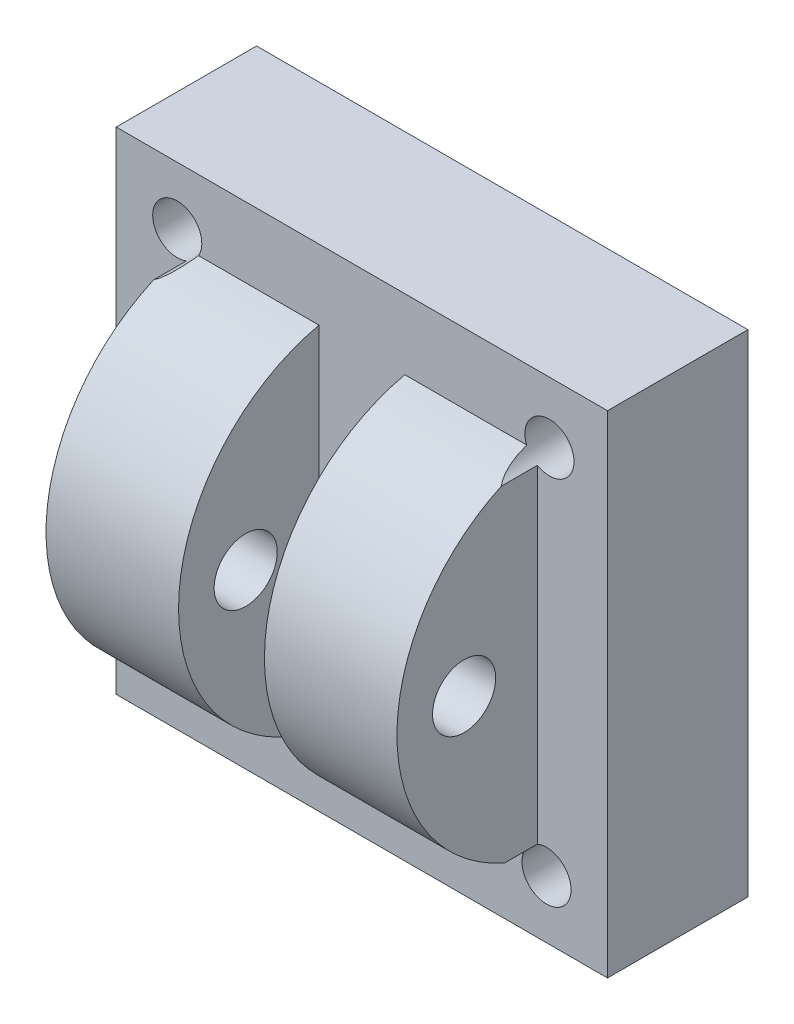
ISO-10303-21;
HEADER;
FILE_DESCRIPTION(('STEP AP214'),'2;1');
FILE_NAME('part.step','',(''),(''),'','','');
FILE_SCHEMA(('AUTOMOTIVE_DESIGN { 1 0 10303 214 1 1 1 1 }'));
ENDSEC;
DATA;
#1=APPLICATION_CONTEXT('core data for automotive mechanical design processes');
#2=APPLICATION_PROTOCOL_DEFINITION('international standard','automotive_design',2000,#1);
#3=PRODUCT_CONTEXT('',#1,'mechanical');
#4=PRODUCT('Part','Part','',(#3));
#5=PRODUCT_RELATED_PRODUCT_CATEGORY('part','',(#4));
#6=PRODUCT_DEFINITION_FORMATION('','',#4);
#7=PRODUCT_DEFINITION_CONTEXT('part definition',#1,'design');
#8=PRODUCT_DEFINITION('design','',#6,#7);
#9=PRODUCT_DEFINITION_SHAPE('','',#8);
#10=(LENGTH_UNIT() NAMED_UNIT(*) SI_UNIT(.MILLI.,.METRE.));
#11=(NAMED_UNIT(*) PLANE_ANGLE_UNIT() SI_UNIT($,.RADIAN.));
#12=(NAMED_UNIT(*) SI_UNIT($,.STERADIAN.) SOLID_ANGLE_UNIT());
#13=UNCERTAINTY_MEASURE_WITH_UNIT(LENGTH_MEASURE(1.E-05),#10,'distance_accuracy_value','');
#14=(GEOMETRIC_REPRESENTATION_CONTEXT(3) GLOBAL_UNCERTAINTY_ASSIGNED_CONTEXT((#13)) GLOBAL_UNIT_ASSIGNED_CONTEXT((#10,
#11,#12)) REPRESENTATION_CONTEXT('',''));
#15=CARTESIAN_POINT('',(0.,0.,0.));
#16=DIRECTION('',(0.,0.,1.));
#17=DIRECTION('',(1.,0.,0.));
#18=AXIS2_PLACEMENT_3D('',#15,#16,#17);
#19=CARTESIAN_POINT('',(55.,0.,14.375));
#20=DIRECTION('',(-1.,0.,0.));
#21=DIRECTION('',(0.,-1.,0.));
#22=AXIS2_PLACEMENT_3D('',#19,#20,#21);
#23=CYLINDRICAL_SURFACE('',#22,25.625);
#24=CARTESIAN_POINT('',(25.,-23.4780497008388,24.6425122227802));
#25=CARTESIAN_POINT('',(24.9460577300047,-23.499761418542,24.5928720561947));
#26=CARTESIAN_POINT('',(24.8942716845695,-23.5221405579165,24.5412641723884));
#27=CARTESIAN_POINT('',(24.7947611876694,-23.5678705068853,24.4347922409841));
#28=CARTESIAN_POINT('',(24.7470318551353,-23.5912200969496,24.3799322453001));
#29=CARTESIAN_POINT('',(24.6554907685004,-23.6384601088136,24.2678014862546));
#30=CARTESIAN_POINT('',(24.6116600535536,-23.6623471143517,24.2105446378812));
#31=CARTESIAN_POINT('',(24.5273270779499,-23.7105442553659,24.0937813100441));
#32=CARTESIAN_POINT('',(24.4868259575929,-23.7348545323759,24.0342740699822));
#33=CARTESIAN_POINT('',(24.3714087373338,-23.8071641784221,23.8552881995348));
#34=CARTESIAN_POINT('',(24.3008231826752,-23.8554778698159,23.7331328798757));
#35=CARTESIAN_POINT('',(24.169423636464,-23.951928521727,23.4834421750873));
#36=CARTESIAN_POINT('',(24.1086247559706,-24.0000650989001,23.3558988467501));
#37=CARTESIAN_POINT('',(23.9982039093528,-24.0930309785019,23.1033263410913));
#38=CARTESIAN_POINT('',(23.9481752570726,-24.1379053511424,22.9784899886008));
#39=CARTESIAN_POINT('',(23.8545669281035,-24.2264253929525,22.7259787934171));
#40=CARTESIAN_POINT('',(23.8109887932544,-24.2700707663474,22.5983032804528));
#41=CARTESIAN_POINT('',(23.7293672049945,-24.3558793816908,22.340565494858));
#42=CARTESIAN_POINT('',(23.691329246981,-24.3980411209879,22.2105009945903));
#43=CARTESIAN_POINT('',(23.6200973252275,-24.4806349108544,21.9485070648193));
#44=CARTESIAN_POINT('',(23.5869037430669,-24.5210668249926,21.8165774893056));
#45=CARTESIAN_POINT('',(23.5235205470405,-24.6015999747925,21.5459560402335));
#46=CARTESIAN_POINT('',(23.4935003660058,-24.6416256995094,21.4072022428303));
#47=CARTESIAN_POINT('',(23.4374350127471,-24.7195210793935,21.1282860935522));
#48=CARTESIAN_POINT('',(23.4113901678844,-24.7573905568369,20.9881236266878));
#49=CARTESIAN_POINT('',(23.3628742783357,-24.8307268875653,20.7071886023749));
#50=CARTESIAN_POINT('',(23.3403891130663,-24.8662028963675,20.5664208532352));
#51=CARTESIAN_POINT('',(23.2984600523268,-24.9348462514603,20.2839098763923));
#52=CARTESIAN_POINT('',(23.2790153950581,-24.9680141748818,20.1421669023534));
#53=CARTESIAN_POINT('',(23.2608828486923,-25.,20.));
#54=B_SPLINE_CURVE_WITH_KNOTS('',3,(#24,#25,#26,#27,#28,#29,#30,#31,#32,#33,#34,#35,#36,#37,#38,
#39,#40,#41,#42,#43,#44,#45,#46,#47,#48,#49,#50,#51,#52,#53),.UNSPECIFIED.,.F.,.F.,(4,2,2,2,2,2,
2,2,2,2,2,2,2,2,4),(0.,0.229226745910842,0.458173660263693,0.685938074528189,0.913780170048469,
1.36057697383028,1.80805716798525,2.23317760111728,2.65839948545711,3.084040323465,
3.50971467006486,3.95212633851727,4.3945744190865,4.83522086113662,5.2757567217849),.UNSPECIFIED.);
#55=CARTESIAN_POINT('',(25.,-23.4780497008388,24.6425122227802));
#56=VERTEX_POINT('',#55);
#57=CARTESIAN_POINT('',(23.2608828486923,-25.,20.));
#58=VERTEX_POINT('',#57);
#59=EDGE_CURVE('E130',#56,#58,#54,.T.);
#60=ORIENTED_EDGE('',*,*,#59,.F.);
#61=CARTESIAN_POINT('',(25.,0.,14.375));
#62=DIRECTION('',(-1.,0.,0.));
#63=DIRECTION('',(0.,-1.,0.));
#64=AXIS2_PLACEMENT_3D('',#61,#62,#63);
#65=CIRCLE('',#64,25.625);
#66=CARTESIAN_POINT('',(25.,23.2608828486923,25.1254397165611));
#67=VERTEX_POINT('',#66);
#68=EDGE_CURVE('E140',#56,#67,#65,.T.);
#69=ORIENTED_EDGE('',*,*,#68,.T.);
#70=CARTESIAN_POINT('',(23.4780497008388,25.,20.));
#71=CARTESIAN_POINT('',(23.4925982336486,24.9638638748352,20.1606129859631));
#72=CARTESIAN_POINT('',(23.5084375576079,24.926199606182,20.3207746634877));
#73=CARTESIAN_POINT('',(23.5431749047335,24.8478685660252,20.6400663222747));
#74=CARTESIAN_POINT('',(23.5620736271427,24.8072011092842,20.7991960590131));
#75=CARTESIAN_POINT('',(23.6034872272219,24.722757566495,21.1168851379874));
#76=CARTESIAN_POINT('',(23.6260169223378,24.6789691712187,21.2754392979252));
#77=CARTESIAN_POINT('',(23.6752100229333,24.5885303759436,21.5910754408915));
#78=CARTESIAN_POINT('',(23.7018731113553,24.5418801956276,21.7481575358574));
#79=CARTESIAN_POINT('',(23.7590979861725,24.4473339719538,22.0557263883024));
#80=CARTESIAN_POINT('',(23.7895124860491,24.3995219807562,22.2062661873048));
#81=CARTESIAN_POINT('',(23.8555661323313,24.3014820189495,22.5053975549693));
#82=CARTESIAN_POINT('',(23.891204896734,24.2512542251662,22.6539892652127));
#83=CARTESIAN_POINT('',(23.9685067519478,24.148661450849,22.9486266328127));
#84=CARTESIAN_POINT('',(24.0101617217786,24.09629941854,23.0946754295893));
#85=CARTESIAN_POINT('',(24.1005343334445,23.9896860009986,23.3838469633824));
#86=CARTESIAN_POINT('',(24.1492501938535,23.9354350949346,23.5269704280836));
#87=CARTESIAN_POINT('',(24.2506032962889,23.8300138897763,23.7978658104024));
#88=CARTESIAN_POINT('',(24.302581900082,23.7789604321087,23.9259276326169));
#89=CARTESIAN_POINT('',(24.4146244730589,23.6761304806509,24.1780602375544));
#90=CARTESIAN_POINT('',(24.4746822709898,23.624354565499,24.3021339778028));
#91=CARTESIAN_POINT('',(24.6051991458003,23.5199953615266,24.5469399431388));
#92=CARTESIAN_POINT('',(24.6757900994772,23.4674107753053,24.6676025995068));
#93=CARTESIAN_POINT('',(24.7903584982675,23.3892167437992,24.8434912791428));
#94=CARTESIAN_POINT('',(24.8300562489188,23.3632302060941,24.9013468587913));
#95=CARTESIAN_POINT('',(24.9126036730819,23.3116846381956,25.015013817973));
#96=CARTESIAN_POINT('',(24.9554551071901,23.286125856727,25.0708240292017));
#97=CARTESIAN_POINT('',(25.,23.2608828486923,25.1254397165611));
#98=B_SPLINE_CURVE_WITH_KNOTS('',3,(#70,#71,#72,#73,#74,#75,#76,#77,#78,#79,#80,#81,#82,#83,#84,
#85,#86,#87,#88,#89,#90,#91,#92,#93,#94,#95,#96,#97),.UNSPECIFIED.,.F.,.F.,(4,2,2,2,2,2,2,2,2,2,
2,2,2,4),(0.,0.495809519374458,0.991732519250151,1.48973308414232,1.98769546811097,
2.4701489855663,2.95256724317582,3.43434029085299,3.91599200058518,4.35776456820604,
4.79920158605405,5.2467191557984,5.47110303021228,5.69561313501714),.UNSPECIFIED.);
#99=CARTESIAN_POINT('',(23.4780497008388,25.,20.));
#100=VERTEX_POINT('',#99);
#101=EDGE_CURVE('E153',#100,#67,#98,.T.);
#102=ORIENTED_EDGE('',*,*,#101,.F.);
#103=DIRECTION('',(-1.,0.,0.));
#104=VECTOR('',#103,1.);
#105=CARTESIAN_POINT('',(55.,25.,20.));
#106=LINE('',#105,#104);
#107=CARTESIAN_POINT('',(6.1193379416289,25.,20.));
#108=VERTEX_POINT('',#107);
#109=EDGE_CURVE('E44',#100,#108,#106,.T.);
#110=ORIENTED_EDGE('',*,*,#109,.T.);
#111=CARTESIAN_POINT('',(6.1193379416289,0.,14.375));
#112=DIRECTION('',(1.,0.,0.));
#113=DIRECTION('',(0.,0.,-1.));
#114=AXIS2_PLACEMENT_3D('',#111,#112,#113);
#115=CIRCLE('',#114,25.625);
#116=CARTESIAN_POINT('',(6.1193379416289,-25.,20.));
#117=VERTEX_POINT('',#116);
#118=EDGE_CURVE('E288',#117,#108,#115,.F.);
#119=ORIENTED_EDGE('',*,*,#118,.F.);
#120=DIRECTION('',(-1.,0.,0.));
#121=VECTOR('',#120,1.);
#122=CARTESIAN_POINT('',(55.,-25.,20.));
#123=LINE('',#122,#121);
#124=EDGE_CURVE('E258',#58,#117,#123,.T.);
#125=ORIENTED_EDGE('',*,*,#124,.F.);
#126=EDGE_LOOP('',(#60,#69,#102,#110,#119,#125));
#127=FACE_BOUND('',#126,.T.);
#128=ADVANCED_FACE('F34',(#127),#23,.T.);
#129=CARTESIAN_POINT('',(-25.,25.,40.));
#130=DIRECTION('',(1.,0.,0.));
#131=DIRECTION('',(0.,1.,0.));
#132=AXIS2_PLACEMENT_3D('',#129,#130,#131);
#133=PLANE('',#132);
#134=CARTESIAN_POINT('',(-25.,0.,30.4341456002103));
#135=DIRECTION('',(-1.,0.,0.));
#136=DIRECTION('',(0.,-1.,0.));
#137=AXIS2_PLACEMENT_3D('',#134,#135,#136);
#138=CIRCLE('',#137,4.5);
#139=CARTESIAN_POINT('',(-25.,-4.5,30.4341456002103));
#140=VERTEX_POINT('',#139);
#141=EDGE_CURVE('E249',#140,#140,#138,.T.);
#142=ORIENTED_EDGE('',*,*,#141,.F.);
#143=EDGE_LOOP('',(#142));
#144=FACE_BOUND('',#143,.T.);
#145=DIRECTION('',(0.,-1.,0.));
#146=VECTOR('',#145,1.);
#147=CARTESIAN_POINT('',(-25.,25.,20.));
#148=LINE('',#147,#146);
#149=CARTESIAN_POINT('',(-25.,23.4780497008388,20.));
#150=VERTEX_POINT('',#149);
#151=CARTESIAN_POINT('',(-25.,-23.2608828486923,20.));
#152=VERTEX_POINT('',#151);
#153=EDGE_CURVE('E252',#150,#152,#148,.T.);
#154=ORIENTED_EDGE('',*,*,#153,.T.);
#155=DIRECTION('',(0.,0.,-1.));
#156=VECTOR('',#155,1.);
#157=CARTESIAN_POINT('',(-25.,-23.2608828486923,35.));
#158=LINE('',#157,#156);
#159=CARTESIAN_POINT('',(-25.,-23.2608828486923,25.125439716561));
#160=VERTEX_POINT('',#159);
#161=EDGE_CURVE('E52',#152,#160,#158,.F.);
#162=ORIENTED_EDGE('',*,*,#161,.T.);
#163=CARTESIAN_POINT('',(-25.,0.,14.375));
#164=DIRECTION('',(-1.,0.,0.));
#165=DIRECTION('',(0.,1.,0.));
#166=AXIS2_PLACEMENT_3D('',#163,#164,#165);
#167=CIRCLE('',#166,25.625);
#168=CARTESIAN_POINT('',(-25.,23.4780497008388,24.6425122227803));
#169=VERTEX_POINT('',#168);
#170=EDGE_CURVE('E256',#160,#169,#167,.T.);
#171=ORIENTED_EDGE('',*,*,#170,.T.);
#172=DIRECTION('',(0.,0.,-1.));
#173=VECTOR('',#172,1.);
#174=CARTESIAN_POINT('',(-25.,23.4780497008388,35.));
#175=LINE('',#174,#173);
#176=EDGE_CURVE('E151',#169,#150,#175,.T.);
#177=ORIENTED_EDGE('',*,*,#176,.T.);
#178=EDGE_LOOP('',(#154,#162,#171,#177));
#179=FACE_BOUND('',#178,.T.);
#180=ADVANCED_FACE('F237',(#144,#179),#133,.F.);
#181=CARTESIAN_POINT('',(-23.4780497008388,-25.,20.));
#182=CARTESIAN_POINT('',(-23.4925982336486,-24.9638638748352,20.1606129859631));
#183=CARTESIAN_POINT('',(-23.5084375576079,-24.926199606182,20.3207746634877));
#184=CARTESIAN_POINT('',(-23.5431749047335,-24.8478685660252,20.6400663222747));
#185=CARTESIAN_POINT('',(-23.5620736271427,-24.8072011092841,20.7991960590131));
#186=CARTESIAN_POINT('',(-23.6034872272219,-24.722757566495,21.1168851379874));
#187=CARTESIAN_POINT('',(-23.6260169223378,-24.6789691712187,21.2754392979252));
#188=CARTESIAN_POINT('',(-23.6752100229333,-24.5885303759436,21.5910754408915));
#189=CARTESIAN_POINT('',(-23.7018731113553,-24.5418801956275,21.7481575358574));
#190=CARTESIAN_POINT('',(-23.7590979861725,-24.4473339719538,22.0557263883024));
#191=CARTESIAN_POINT('',(-23.7895124860492,-24.3995219807562,22.2062661873048));
#192=CARTESIAN_POINT('',(-23.8555661323313,-24.3014820189495,22.5053975549693));
#193=CARTESIAN_POINT('',(-23.8912048967341,-24.2512542251662,22.6539892652127));
#194=CARTESIAN_POINT('',(-23.9685067519479,-24.148661450849,22.9486266328127));
#195=CARTESIAN_POINT('',(-24.0101617217786,-24.09629941854,23.0946754295893));
#196=CARTESIAN_POINT('',(-24.1005343334445,-23.9896860009986,23.3838469633824));
#197=CARTESIAN_POINT('',(-24.1492501938535,-23.9354350949345,23.5269704280836));
#198=CARTESIAN_POINT('',(-24.2506032962889,-23.8300138897763,23.7978658104024));
#199=CARTESIAN_POINT('',(-24.302581900082,-23.7789604321087,23.9259276326169));
#200=CARTESIAN_POINT('',(-24.4146244730589,-23.6761304806509,24.1780602375544));
#201=CARTESIAN_POINT('',(-24.4746822709898,-23.624354565499,24.3021339778027));
#202=CARTESIAN_POINT('',(-24.6051991458003,-23.5199953615266,24.5469399431388));
#203=CARTESIAN_POINT('',(-24.6757900994773,-23.4674107753053,24.6676025995068));
#204=CARTESIAN_POINT('',(-24.7903584982675,-23.3892167437992,24.8434912791428));
#205=CARTESIAN_POINT('',(-24.8300562489188,-23.3632302060941,24.9013468587913));
#206=CARTESIAN_POINT('',(-24.912603673082,-23.3116846381956,25.0150138179729));
#207=CARTESIAN_POINT('',(-24.9554551071901,-23.286125856727,25.0708240292017));
#208=CARTESIAN_POINT('',(-25.,-23.2608828486923,25.125439716561));
#209=B_SPLINE_CURVE_WITH_KNOTS('',3,(#181,#182,#183,#184,#185,#186,#187,#188,#189,#190,#191,
#192,#193,#194,#195,#196,#197,#198,#199,#200,#201,#202,#203,#204,#205,#206,#207,#208),
.UNSPECIFIED.,.F.,.F.,(4,2,2,2,2,2,2,2,2,2,2,2,2,4),(0.,0.495809519374454,0.991732519250148,
1.48973308414231,1.98769546811097,2.47014898556631,2.95256724317582,3.434340290853,
3.91599200058518,4.35776456820602,4.79920158605403,5.24671915579837,5.47110303021225,
5.69561313501711),.UNSPECIFIED.);
#210=CARTESIAN_POINT('',(-23.4780497008388,-25.,20.));
#211=VERTEX_POINT('',#210);
#212=EDGE_CURVE('E352',#211,#160,#209,.T.);
#213=ORIENTED_EDGE('',*,*,#212,.F.);
#214=CARTESIAN_POINT('',(-6.1193379416289,-25.,20.));
#215=VERTEX_POINT('',#214);
#216=EDGE_CURVE('E255',#215,#211,#123,.T.);
#217=ORIENTED_EDGE('',*,*,#216,.F.);
#218=CARTESIAN_POINT('',(-6.1193379416289,0.,14.375));
#219=DIRECTION('',(-1.,0.,0.));
#220=DIRECTION('',(0.,0.,1.));
#221=AXIS2_PLACEMENT_3D('',#218,#219,#220);
#222=CIRCLE('',#221,25.625);
#223=CARTESIAN_POINT('',(-6.1193379416289,25.,20.));
#224=VERTEX_POINT('',#223);
#225=EDGE_CURVE('E298',#224,#215,#222,.F.);
#226=ORIENTED_EDGE('',*,*,#225,.F.);
#227=CARTESIAN_POINT('',(-23.2608828486923,25.,20.));
#228=VERTEX_POINT('',#227);
#229=EDGE_CURVE('E264',#224,#228,#106,.T.);
#230=ORIENTED_EDGE('',*,*,#229,.T.);
#231=CARTESIAN_POINT('',(-25.,23.4780497008388,24.6425122227803));
#232=CARTESIAN_POINT('',(-24.9460577300047,23.4997614185419,24.5928720561948));
#233=CARTESIAN_POINT('',(-24.8942716845695,23.5221405579165,24.5412641723884));
#234=CARTESIAN_POINT('',(-24.7947611876694,23.5678705068853,24.4347922409841));
#235=CARTESIAN_POINT('',(-24.7470318551353,23.5912200969496,24.3799322453001));
#236=CARTESIAN_POINT('',(-24.6554907685004,23.6384601088136,24.2678014862547));
#237=CARTESIAN_POINT('',(-24.6116600535536,23.6623471143517,24.2105446378813));
#238=CARTESIAN_POINT('',(-24.5273270779499,23.7105442553659,24.0937813100442));
#239=CARTESIAN_POINT('',(-24.4868259575929,23.7348545323759,24.0342740699822));
#240=CARTESIAN_POINT('',(-24.3714087373338,23.807164178422,23.8552881995349));
#241=CARTESIAN_POINT('',(-24.3008231826752,23.8554778698159,23.7331328798758));
#242=CARTESIAN_POINT('',(-24.169423636464,23.951928521727,23.4834421750873));
#243=CARTESIAN_POINT('',(-24.1086247559706,24.0000650989001,23.3558988467501));
#244=CARTESIAN_POINT('',(-23.9982039093528,24.0930309785019,23.1033263410914));
#245=CARTESIAN_POINT('',(-23.9481752570726,24.1379053511424,22.9784899886009));
#246=CARTESIAN_POINT('',(-23.8545669281035,24.2264253929525,22.7259787934171));
#247=CARTESIAN_POINT('',(-23.8109887932544,24.2700707663474,22.5983032804529));
#248=CARTESIAN_POINT('',(-23.7293672049945,24.3558793816908,22.3405654948581));
#249=CARTESIAN_POINT('',(-23.691329246981,24.3980411209879,22.2105009945904));
#250=CARTESIAN_POINT('',(-23.6200973252275,24.4806349108544,21.9485070648194));
#251=CARTESIAN_POINT('',(-23.5869037430669,24.5210668249926,21.8165774893056));
#252=CARTESIAN_POINT('',(-23.5235205470405,24.6015999747925,21.5459560402335));
#253=CARTESIAN_POINT('',(-23.4935003660058,24.6416256995094,21.4072022428304));
#254=CARTESIAN_POINT('',(-23.4374350127471,24.7195210793935,21.1282860935522));
#255=CARTESIAN_POINT('',(-23.4113901678844,24.7573905568369,20.9881236266878));
#256=CARTESIAN_POINT('',(-23.3628742783357,24.8307268875653,20.707188602375));
#257=CARTESIAN_POINT('',(-23.3403891130662,24.8662028963675,20.5664208532352));
#258=CARTESIAN_POINT('',(-23.2984600523268,24.9348462514603,20.2839098763924));
#259=CARTESIAN_POINT('',(-23.2790153950581,24.9680141748818,20.1421669023534));
#260=CARTESIAN_POINT('',(-23.2608828486923,25.,20.));
#261=B_SPLINE_CURVE_WITH_KNOTS('',3,(#231,#232,#233,#234,#235,#236,#237,#238,#239,#240,#241,
#242,#243,#244,#245,#246,#247,#248,#249,#250,#251,#252,#253,#254,#255,#256,#257,#258,#259,#260),
.UNSPECIFIED.,.F.,.F.,(4,2,2,2,2,2,2,2,2,2,2,2,2,2,4),(0.,0.229226745910839,0.458173660263692,
0.685938074528188,0.913780170048475,1.36057697383028,1.80805716798525,2.23317760111729,
2.65839948545713,3.08404032346503,3.5097146700649,3.95212633851732,4.39457441908656,
4.83522086113668,5.27575672178497),.UNSPECIFIED.);
#262=EDGE_CURVE('E60',#169,#228,#261,.T.);
#263=ORIENTED_EDGE('',*,*,#262,.F.);
#264=ORIENTED_EDGE('',*,*,#170,.F.);
#265=EDGE_LOOP('',(#213,#217,#226,#230,#263,#264));
#266=FACE_BOUND('',#265,.T.);
#267=ADVANCED_FACE('F36',(#266),#23,.T.);
#268=CARTESIAN_POINT('',(25.,25.,40.));
#269=DIRECTION('',(-1.,0.,0.));
#270=DIRECTION('',(0.,-1.,0.));
#271=AXIS2_PLACEMENT_3D('',#268,#269,#270);
#272=PLANE('',#271);
#273=CARTESIAN_POINT('',(25.,0.,30.4341456002103));
#274=DIRECTION('',(-1.,0.,0.));
#275=DIRECTION('',(0.,-1.,0.));
#276=AXIS2_PLACEMENT_3D('',#273,#274,#275);
#277=CIRCLE('',#276,4.5);
#278=CARTESIAN_POINT('',(25.,-4.49999999999999,30.4341456002103));
#279=VERTEX_POINT('',#278);
#280=EDGE_CURVE('E303',#279,#279,#277,.T.);
#281=ORIENTED_EDGE('',*,*,#280,.T.);
#282=EDGE_LOOP('',(#281));
#283=FACE_BOUND('',#282,.T.);
#284=ORIENTED_EDGE('',*,*,#68,.F.);
#285=DIRECTION('',(0.,0.,-1.));
#286=VECTOR('',#285,1.);
#287=CARTESIAN_POINT('',(25.,-23.4780497008388,35.));
#288=LINE('',#287,#286);
#289=CARTESIAN_POINT('',(25.,-23.4780497008388,20.));
#290=VERTEX_POINT('',#289);
#291=EDGE_CURVE('E128',#56,#290,#288,.T.);
#292=ORIENTED_EDGE('',*,*,#291,.T.);
#293=DIRECTION('',(0.,1.,0.));
#294=VECTOR('',#293,1.);
#295=CARTESIAN_POINT('',(25.,25.,20.));
#296=LINE('',#295,#294);
#297=CARTESIAN_POINT('',(25.,23.2608828486923,20.));
#298=VERTEX_POINT('',#297);
#299=EDGE_CURVE('E12',#290,#298,#296,.T.);
#300=ORIENTED_EDGE('',*,*,#299,.T.);
#301=DIRECTION('',(0.,0.,-1.));
#302=VECTOR('',#301,1.);
#303=CARTESIAN_POINT('',(25.,23.2608828486923,35.));
#304=LINE('',#303,#302);
#305=EDGE_CURVE('E150',#298,#67,#304,.F.);
#306=ORIENTED_EDGE('',*,*,#305,.T.);
#307=EDGE_LOOP('',(#284,#292,#300,#306));
#308=FACE_BOUND('',#307,.T.);
#309=ADVANCED_FACE('F137',(#283,#308),#272,.F.);
#310=CARTESIAN_POINT('',(0.,0.,20.));
#311=DIRECTION('',(0.,0.,-1.));
#312=DIRECTION('',(-1.,0.,0.));
#313=AXIS2_PLACEMENT_3D('',#310,#311,#312);
#314=PLANE('',#313);
#315=ORIENTED_EDGE('',*,*,#299,.F.);
#316=CARTESIAN_POINT('',(26.3061584600324,-26.7251946124937,20.));
#317=DIRECTION('',(0.,0.,-1.));
#318=DIRECTION('',(-1.,0.,0.));
#319=AXIS2_PLACEMENT_3D('',#316,#317,#318);
#320=CIRCLE('',#319,3.5);
#321=EDGE_CURVE('E125',#290,#58,#320,.T.);
#322=ORIENTED_EDGE('',*,*,#321,.T.);
#323=ORIENTED_EDGE('',*,*,#124,.T.);
#324=DIRECTION('',(0.,1.,0.));
#325=VECTOR('',#324,1.);
#326=CARTESIAN_POINT('',(6.1193379416289,-35.,20.));
#327=LINE('',#326,#325);
#328=EDGE_CURVE('E301',#117,#108,#327,.T.);
#329=ORIENTED_EDGE('',*,*,#328,.T.);
#330=ORIENTED_EDGE('',*,*,#109,.F.);
#331=CARTESIAN_POINT('',(26.7251946124936,26.3061584600324,20.));
#332=DIRECTION('',(0.,0.,-1.));
#333=DIRECTION('',(-1.,0.,0.));
#334=AXIS2_PLACEMENT_3D('',#331,#332,#333);
#335=CIRCLE('',#334,3.5);
#336=EDGE_CURVE('E146',#100,#298,#335,.T.);
#337=ORIENTED_EDGE('',*,*,#336,.T.);
#338=EDGE_LOOP('',(#315,#322,#323,#329,#330,#337));
#339=FACE_BOUND('',#338,.T.);
#340=ORIENTED_EDGE('',*,*,#216,.T.);
#341=CARTESIAN_POINT('',(-26.7251946124937,-26.3061584600324,20.));
#342=DIRECTION('',(0.,0.,-1.));
#343=DIRECTION('',(-1.,0.,0.));
#344=AXIS2_PLACEMENT_3D('',#341,#342,#343);
#345=CIRCLE('',#344,3.5);
#346=EDGE_CURVE('E350',#211,#152,#345,.T.);
#347=ORIENTED_EDGE('',*,*,#346,.T.);
#348=ORIENTED_EDGE('',*,*,#153,.F.);
#349=CARTESIAN_POINT('',(-26.3061584600324,26.7251946124937,20.));
#350=DIRECTION('',(0.,0.,-1.));
#351=DIRECTION('',(-1.,0.,0.));
#352=AXIS2_PLACEMENT_3D('',#349,#350,#351);
#353=CIRCLE('',#352,3.5);
#354=EDGE_CURVE('E369',#150,#228,#353,.T.);
#355=ORIENTED_EDGE('',*,*,#354,.T.);
#356=ORIENTED_EDGE('',*,*,#229,.F.);
#357=DIRECTION('',(0.,1.,0.));
#358=VECTOR('',#357,1.);
#359=CARTESIAN_POINT('',(-6.1193379416289,-35.,20.));
#360=LINE('',#359,#358);
#361=EDGE_CURVE('E300',#215,#224,#360,.T.);
#362=ORIENTED_EDGE('',*,*,#361,.F.);
#363=EDGE_LOOP('',(#340,#347,#348,#355,#356,#362));
#364=FACE_BOUND('',#363,.T.);
#365=DIRECTION('',(0.,1.,0.));
#366=VECTOR('',#365,1.);
#367=CARTESIAN_POINT('',(-35.,35.,20.));
#368=LINE('',#367,#366);
#369=CARTESIAN_POINT('',(-35.,-35.,20.));
#370=VERTEX_POINT('',#369);
#371=CARTESIAN_POINT('',(-35.,35.,20.));
#372=VERTEX_POINT('',#371);
#373=EDGE_CURVE('E285',#370,#372,#368,.T.);
#374=ORIENTED_EDGE('',*,*,#373,.F.);
#375=DIRECTION('',(-1.,0.,0.));
#376=VECTOR('',#375,1.);
#377=CARTESIAN_POINT('',(35.,-35.,20.));
#378=LINE('',#377,#376);
#379=CARTESIAN_POINT('',(35.,-35.,20.));
#380=VERTEX_POINT('',#379);
#381=EDGE_CURVE('E278',#380,#370,#378,.T.);
#382=ORIENTED_EDGE('',*,*,#381,.F.);
#383=DIRECTION('',(0.,-1.,0.));
#384=VECTOR('',#383,1.);
#385=CARTESIAN_POINT('',(35.,35.,20.));
#386=LINE('',#385,#384);
#387=CARTESIAN_POINT('',(35.,35.,20.));
#388=VERTEX_POINT('',#387);
#389=EDGE_CURVE('E281',#388,#380,#386,.T.);
#390=ORIENTED_EDGE('',*,*,#389,.F.);
#391=DIRECTION('',(1.,0.,0.));
#392=VECTOR('',#391,1.);
#393=CARTESIAN_POINT('',(35.,35.,20.));
#394=LINE('',#393,#392);
#395=EDGE_CURVE('E283',#372,#388,#394,.T.);
#396=ORIENTED_EDGE('',*,*,#395,.F.);
#397=EDGE_LOOP('',(#374,#382,#390,#396));
#398=FACE_BOUND('',#397,.T.);
#399=ADVANCED_FACE('F143',(#339,#364,#398),#314,.F.);
#400=CARTESIAN_POINT('',(-35.,35.,0.));
#401=DIRECTION('',(1.,0.,0.));
#402=DIRECTION('',(0.,0.,-1.));
#403=AXIS2_PLACEMENT_3D('',#400,#401,#402);
#404=PLANE('',#403);
#405=ORIENTED_EDGE('',*,*,#373,.T.);
#406=DIRECTION('',(0.,0.,1.));
#407=VECTOR('',#406,1.);
#408=CARTESIAN_POINT('',(-35.,35.,0.));
#409=LINE('',#408,#407);
#410=CARTESIAN_POINT('',(-35.,35.,0.));
#411=VERTEX_POINT('',#410);
#412=EDGE_CURVE('E260',#411,#372,#409,.T.);
#413=ORIENTED_EDGE('',*,*,#412,.F.);
#414=DIRECTION('',(0.,1.,0.));
#415=VECTOR('',#414,1.);
#416=CARTESIAN_POINT('',(-35.,35.,0.));
#417=LINE('',#416,#415);
#418=CARTESIAN_POINT('',(-35.,-35.,0.));
#419=VERTEX_POINT('',#418);
#420=EDGE_CURVE('E280',#419,#411,#417,.T.);
#421=ORIENTED_EDGE('',*,*,#420,.F.);
#422=DIRECTION('',(0.,0.,1.));
#423=VECTOR('',#422,1.);
#424=CARTESIAN_POINT('',(-35.,-35.,0.));
#425=LINE('',#424,#423);
#426=EDGE_CURVE('E274',#419,#370,#425,.T.);
#427=ORIENTED_EDGE('',*,*,#426,.T.);
#428=EDGE_LOOP('',(#405,#413,#421,#427));
#429=FACE_BOUND('',#428,.T.);
#430=ADVANCED_FACE('F220',(#429),#404,.F.);
#431=CARTESIAN_POINT('',(35.,35.,0.));
#432=DIRECTION('',(0.,-1.,0.));
#433=DIRECTION('',(0.,0.,-1.));
#434=AXIS2_PLACEMENT_3D('',#431,#432,#433);
#435=PLANE('',#434);
#436=ORIENTED_EDGE('',*,*,#395,.T.);
#437=DIRECTION('',(0.,0.,1.));
#438=VECTOR('',#437,1.);
#439=CARTESIAN_POINT('',(35.,35.,0.));
#440=LINE('',#439,#438);
#441=CARTESIAN_POINT('',(35.,35.,0.));
#442=VERTEX_POINT('',#441);
#443=EDGE_CURVE('E268',#442,#388,#440,.T.);
#444=ORIENTED_EDGE('',*,*,#443,.F.);
#445=DIRECTION('',(1.,0.,0.));
#446=VECTOR('',#445,1.);
#447=CARTESIAN_POINT('',(35.,35.,0.));
#448=LINE('',#447,#446);
#449=EDGE_CURVE('E292',#411,#442,#448,.T.);
#450=ORIENTED_EDGE('',*,*,#449,.F.);
#451=ORIENTED_EDGE('',*,*,#412,.T.);
#452=EDGE_LOOP('',(#436,#444,#450,#451));
#453=FACE_BOUND('',#452,.T.);
#454=ADVANCED_FACE('F227',(#453),#435,.F.);
#455=CARTESIAN_POINT('',(35.,35.,0.));
#456=DIRECTION('',(-1.,0.,0.));
#457=DIRECTION('',(0.,-1.,0.));
#458=AXIS2_PLACEMENT_3D('',#455,#456,#457);
#459=PLANE('',#458);
#460=ORIENTED_EDGE('',*,*,#389,.T.);
#461=DIRECTION('',(0.,0.,1.));
#462=VECTOR('',#461,1.);
#463=CARTESIAN_POINT('',(35.,-35.,0.));
#464=LINE('',#463,#462);
#465=CARTESIAN_POINT('',(35.,-35.,0.));
#466=VERTEX_POINT('',#465);
#467=EDGE_CURVE('E271',#466,#380,#464,.T.);
#468=ORIENTED_EDGE('',*,*,#467,.F.);
#469=DIRECTION('',(0.,-1.,0.));
#470=VECTOR('',#469,1.);
#471=CARTESIAN_POINT('',(35.,35.,0.));
#472=LINE('',#471,#470);
#473=EDGE_CURVE('E290',#442,#466,#472,.T.);
#474=ORIENTED_EDGE('',*,*,#473,.F.);
#475=ORIENTED_EDGE('',*,*,#443,.T.);
#476=EDGE_LOOP('',(#460,#468,#474,#475));
#477=FACE_BOUND('',#476,.T.);
#478=ADVANCED_FACE('F223',(#477),#459,.F.);
#479=CARTESIAN_POINT('',(35.,-35.,0.));
#480=DIRECTION('',(0.,1.,0.));
#481=DIRECTION('',(0.,0.,1.));
#482=AXIS2_PLACEMENT_3D('',#479,#480,#481);
#483=PLANE('',#482);
#484=ORIENTED_EDGE('',*,*,#381,.T.);
#485=ORIENTED_EDGE('',*,*,#426,.F.);
#486=DIRECTION('',(-1.,0.,0.));
#487=VECTOR('',#486,1.);
#488=CARTESIAN_POINT('',(35.,-35.,0.));
#489=LINE('',#488,#487);
#490=EDGE_CURVE('E277',#466,#419,#489,.T.);
#491=ORIENTED_EDGE('',*,*,#490,.F.);
#492=ORIENTED_EDGE('',*,*,#467,.T.);
#493=EDGE_LOOP('',(#484,#485,#491,#492));
#494=FACE_BOUND('',#493,.T.);
#495=ADVANCED_FACE('F216',(#494),#483,.F.);
#496=CARTESIAN_POINT('',(0.,0.,0.));
#497=DIRECTION('',(0.,0.,-1.));
#498=DIRECTION('',(-1.,0.,0.));
#499=AXIS2_PLACEMENT_3D('',#496,#497,#498);
#500=PLANE('',#499);
#501=CARTESIAN_POINT('',(26.3061584600324,-26.7251946124937,0.));
#502=DIRECTION('',(0.,0.,-1.));
#503=DIRECTION('',(-1.,0.,0.));
#504=AXIS2_PLACEMENT_3D('',#501,#502,#503);
#505=CIRCLE('',#504,3.5);
#506=CARTESIAN_POINT('',(22.8061584600324,-26.7251946124937,0.));
#507=VERTEX_POINT('',#506);
#508=EDGE_CURVE('E164',#507,#507,#505,.T.);
#509=ORIENTED_EDGE('',*,*,#508,.F.);
#510=EDGE_LOOP('',(#509));
#511=FACE_BOUND('',#510,.T.);
#512=CARTESIAN_POINT('',(-26.7251946124937,-26.3061584600324,0.));
#513=DIRECTION('',(0.,0.,-1.));
#514=DIRECTION('',(-1.,0.,0.));
#515=AXIS2_PLACEMENT_3D('',#512,#513,#514);
#516=CIRCLE('',#515,3.5);
#517=CARTESIAN_POINT('',(-30.2251946124937,-26.3061584600324,0.));
#518=VERTEX_POINT('',#517);
#519=EDGE_CURVE('E326',#518,#518,#516,.T.);
#520=ORIENTED_EDGE('',*,*,#519,.F.);
#521=EDGE_LOOP('',(#520));
#522=FACE_BOUND('',#521,.T.);
#523=CARTESIAN_POINT('',(-26.3061584600324,26.7251946124937,0.));
#524=DIRECTION('',(0.,0.,-1.));
#525=DIRECTION('',(-1.,0.,0.));
#526=AXIS2_PLACEMENT_3D('',#523,#524,#525);
#527=CIRCLE('',#526,3.5);
#528=CARTESIAN_POINT('',(-29.8061584600324,26.7251946124937,0.));
#529=VERTEX_POINT('',#528);
#530=EDGE_CURVE('E328',#529,#529,#527,.T.);
#531=ORIENTED_EDGE('',*,*,#530,.F.);
#532=EDGE_LOOP('',(#531));
#533=FACE_BOUND('',#532,.T.);
#534=CARTESIAN_POINT('',(26.7251946124936,26.3061584600324,0.));
#535=DIRECTION('',(0.,0.,-1.));
#536=DIRECTION('',(-1.,0.,0.));
#537=AXIS2_PLACEMENT_3D('',#534,#535,#536);
#538=CIRCLE('',#537,3.5);
#539=CARTESIAN_POINT('',(23.2251946124936,26.3061584600324,0.));
#540=VERTEX_POINT('',#539);
#541=EDGE_CURVE('E165',#540,#540,#538,.T.);
#542=ORIENTED_EDGE('',*,*,#541,.F.);
#543=EDGE_LOOP('',(#542));
#544=FACE_BOUND('',#543,.T.);
#545=CARTESIAN_POINT('',(0.,0.,0.));
#546=DIRECTION('',(0.,0.,-1.));
#547=DIRECTION('',(-1.,0.,0.));
#548=AXIS2_PLACEMENT_3D('',#545,#546,#547);
#549=CIRCLE('',#548,30.);
#550=CARTESIAN_POINT('',(-30.,0.,0.));
#551=VERTEX_POINT('',#550);
#552=EDGE_CURVE('E313',#551,#551,#549,.T.);
#553=ORIENTED_EDGE('',*,*,#552,.F.);
#554=EDGE_LOOP('',(#553));
#555=FACE_BOUND('',#554,.T.);
#556=ORIENTED_EDGE('',*,*,#420,.T.);
#557=ORIENTED_EDGE('',*,*,#449,.T.);
#558=ORIENTED_EDGE('',*,*,#473,.T.);
#559=ORIENTED_EDGE('',*,*,#490,.T.);
#560=EDGE_LOOP('',(#556,#557,#558,#559));
#561=FACE_BOUND('',#560,.T.);
#562=ADVANCED_FACE('F212',(#511,#522,#533,#544,#555,#561),#500,.T.);
#563=CARTESIAN_POINT('',(6.1193379416289,-35.,40.));
#564=DIRECTION('',(1.,0.,0.));
#565=DIRECTION('',(0.,0.,-1.));
#566=AXIS2_PLACEMENT_3D('',#563,#564,#565);
#567=PLANE('',#566);
#568=CARTESIAN_POINT('',(6.1193379416289,0.,30.4341456002103));
#569=DIRECTION('',(1.,0.,0.));
#570=DIRECTION('',(0.,0.,-1.));
#571=AXIS2_PLACEMENT_3D('',#568,#569,#570);
#572=CIRCLE('',#571,4.5);
#573=CARTESIAN_POINT('',(6.1193379416289,0.,25.9341456002103));
#574=VERTEX_POINT('',#573);
#575=EDGE_CURVE('E308',#574,#574,#572,.T.);
#576=ORIENTED_EDGE('',*,*,#575,.T.);
#577=EDGE_LOOP('',(#576));
#578=FACE_BOUND('',#577,.T.);
#579=ORIENTED_EDGE('',*,*,#118,.T.);
#580=ORIENTED_EDGE('',*,*,#328,.F.);
#581=EDGE_LOOP('',(#579,#580));
#582=FACE_BOUND('',#581,.T.);
#583=ADVANCED_FACE('F208',(#578,#582),#567,.F.);
#584=CARTESIAN_POINT('',(-6.1193379416289,-35.,40.));
#585=DIRECTION('',(-1.,0.,0.));
#586=DIRECTION('',(0.,0.,1.));
#587=AXIS2_PLACEMENT_3D('',#584,#585,#586);
#588=PLANE('',#587);
#589=CARTESIAN_POINT('',(-6.1193379416289,0.,30.4341456002103));
#590=DIRECTION('',(-1.,0.,0.));
#591=DIRECTION('',(0.,0.,1.));
#592=AXIS2_PLACEMENT_3D('',#589,#590,#591);
#593=CIRCLE('',#592,4.5);
#594=CARTESIAN_POINT('',(-6.1193379416289,0.,34.9341456002103));
#595=VERTEX_POINT('',#594);
#596=EDGE_CURVE('E39',#595,#595,#593,.T.);
#597=ORIENTED_EDGE('',*,*,#596,.T.);
#598=EDGE_LOOP('',(#597));
#599=FACE_BOUND('',#598,.T.);
#600=ORIENTED_EDGE('',*,*,#225,.T.);
#601=ORIENTED_EDGE('',*,*,#361,.T.);
#602=EDGE_LOOP('',(#600,#601));
#603=FACE_BOUND('',#602,.T.);
#604=ADVANCED_FACE('F205',(#599,#603),#588,.F.);
#605=CARTESIAN_POINT('',(35.,0.,30.4341456002103));
#606=DIRECTION('',(-1.,0.,0.));
#607=DIRECTION('',(0.,-1.,0.));
#608=AXIS2_PLACEMENT_3D('',#605,#606,#607);
#609=CYLINDRICAL_SURFACE('',#608,4.5);
#610=ORIENTED_EDGE('',*,*,#141,.T.);
#611=EDGE_LOOP('',(#610));
#612=FACE_BOUND('',#611,.T.);
#613=ORIENTED_EDGE('',*,*,#596,.F.);
#614=EDGE_LOOP('',(#613));
#615=FACE_BOUND('',#614,.T.);
#616=ADVANCED_FACE('F203',(#612,#615),#609,.F.);
#617=ORIENTED_EDGE('',*,*,#575,.F.);
#618=EDGE_LOOP('',(#617));
#619=FACE_BOUND('',#618,.T.);
#620=ORIENTED_EDGE('',*,*,#280,.F.);
#621=EDGE_LOOP('',(#620));
#622=FACE_BOUND('',#621,.T.);
#623=ADVANCED_FACE('F199',(#619,#622),#609,.F.);
#624=CARTESIAN_POINT('',(0.,0.,5.));
#625=DIRECTION('',(0.,0.,-1.));
#626=DIRECTION('',(-1.,0.,0.));
#627=AXIS2_PLACEMENT_3D('',#624,#625,#626);
#628=CYLINDRICAL_SURFACE('',#627,30.);
#629=CARTESIAN_POINT('',(0.,0.,5.));
#630=DIRECTION('',(0.,0.,-1.));
#631=DIRECTION('',(-1.,0.,0.));
#632=AXIS2_PLACEMENT_3D('',#629,#630,#631);
#633=CIRCLE('',#632,30.);
#634=CARTESIAN_POINT('',(-30.,0.,5.));
#635=VERTEX_POINT('',#634);
#636=EDGE_CURVE('E312',#635,#635,#633,.T.);
#637=ORIENTED_EDGE('',*,*,#636,.F.);
#638=EDGE_LOOP('',(#637));
#639=FACE_BOUND('',#638,.T.);
#640=ORIENTED_EDGE('',*,*,#552,.T.);
#641=EDGE_LOOP('',(#640));
#642=FACE_BOUND('',#641,.T.);
#643=ADVANCED_FACE('F195',(#639,#642),#628,.F.);
#644=CARTESIAN_POINT('',(0.,0.,5.));
#645=DIRECTION('',(0.,0.,-1.));
#646=DIRECTION('',(-1.,0.,0.));
#647=AXIS2_PLACEMENT_3D('',#644,#645,#646);
#648=PLANE('',#647);
#649=CARTESIAN_POINT('',(0.,0.,5.));
#650=DIRECTION('',(0.,0.,-1.));
#651=DIRECTION('',(-1.,0.,0.));
#652=AXIS2_PLACEMENT_3D('',#649,#650,#651);
#653=CIRCLE('',#652,25.);
#654=CARTESIAN_POINT('',(-25.,0.,5.));
#655=VERTEX_POINT('',#654);
#656=EDGE_CURVE('E316',#655,#655,#653,.T.);
#657=ORIENTED_EDGE('',*,*,#656,.F.);
#658=EDGE_LOOP('',(#657));
#659=FACE_BOUND('',#658,.T.);
#660=ORIENTED_EDGE('',*,*,#636,.T.);
#661=EDGE_LOOP('',(#660));
#662=FACE_BOUND('',#661,.T.);
#663=ADVANCED_FACE('F191',(#659,#662),#648,.T.);
#664=CARTESIAN_POINT('',(0.,0.,5.));
#665=DIRECTION('',(0.,0.,-1.));
#666=DIRECTION('',(-1.,0.,0.));
#667=AXIS2_PLACEMENT_3D('',#664,#665,#666);
#668=CYLINDRICAL_SURFACE('',#667,25.);
#669=ORIENTED_EDGE('',*,*,#656,.T.);
#670=EDGE_LOOP('',(#669));
#671=FACE_BOUND('',#670,.T.);
#672=CARTESIAN_POINT('',(0.,0.,0.));
#673=DIRECTION('',(0.,0.,-1.));
#674=DIRECTION('',(-1.,0.,0.));
#675=AXIS2_PLACEMENT_3D('',#672,#673,#674);
#676=CIRCLE('',#675,25.);
#677=CARTESIAN_POINT('',(-25.,0.,0.));
#678=VERTEX_POINT('',#677);
#679=EDGE_CURVE('E319',#678,#678,#676,.T.);
#680=ORIENTED_EDGE('',*,*,#679,.F.);
#681=EDGE_LOOP('',(#680));
#682=FACE_BOUND('',#681,.T.);
#683=ADVANCED_FACE('F176',(#671,#682),#668,.T.);
#684=CARTESIAN_POINT('',(26.7251946124936,26.3061584600324,5.));
#685=DIRECTION('',(0.,0.,-1.));
#686=DIRECTION('',(-1.,0.,0.));
#687=AXIS2_PLACEMENT_3D('',#684,#685,#686);
#688=CYLINDRICAL_SURFACE('',#687,3.5);
#689=ORIENTED_EDGE('',*,*,#541,.T.);
#690=EDGE_LOOP('',(#689));
#691=FACE_BOUND('',#690,.T.);
#692=ORIENTED_EDGE('',*,*,#101,.T.);
#693=ORIENTED_EDGE('',*,*,#305,.F.);
#694=ORIENTED_EDGE('',*,*,#336,.F.);
#695=EDGE_LOOP('',(#692,#693,#694));
#696=FACE_BOUND('',#695,.T.);
#697=ADVANCED_FACE('F172',(#691,#696),#688,.F.);
#698=CARTESIAN_POINT('',(-26.3061584600324,26.7251946124937,5.));
#699=DIRECTION('',(0.,0.,-1.));
#700=DIRECTION('',(-1.,0.,0.));
#701=AXIS2_PLACEMENT_3D('',#698,#699,#700);
#702=CYLINDRICAL_SURFACE('',#701,3.5);
#703=ORIENTED_EDGE('',*,*,#530,.T.);
#704=EDGE_LOOP('',(#703));
#705=FACE_BOUND('',#704,.T.);
#706=ORIENTED_EDGE('',*,*,#262,.T.);
#707=ORIENTED_EDGE('',*,*,#354,.F.);
#708=ORIENTED_EDGE('',*,*,#176,.F.);
#709=EDGE_LOOP('',(#706,#707,#708));
#710=FACE_BOUND('',#709,.T.);
#711=ADVANCED_FACE('F175',(#705,#710),#702,.F.);
#712=CARTESIAN_POINT('',(-26.7251946124937,-26.3061584600324,5.));
#713=DIRECTION('',(0.,0.,-1.));
#714=DIRECTION('',(-1.,0.,0.));
#715=AXIS2_PLACEMENT_3D('',#712,#713,#714);
#716=CYLINDRICAL_SURFACE('',#715,3.5);
#717=ORIENTED_EDGE('',*,*,#519,.T.);
#718=EDGE_LOOP('',(#717));
#719=FACE_BOUND('',#718,.T.);
#720=ORIENTED_EDGE('',*,*,#346,.F.);
#721=ORIENTED_EDGE('',*,*,#212,.T.);
#722=ORIENTED_EDGE('',*,*,#161,.F.);
#723=EDGE_LOOP('',(#720,#721,#722));
#724=FACE_BOUND('',#723,.T.);
#725=ADVANCED_FACE('F180',(#719,#724),#716,.F.);
#726=CARTESIAN_POINT('',(26.3061584600324,-26.7251946124937,5.));
#727=DIRECTION('',(0.,0.,-1.));
#728=DIRECTION('',(-1.,0.,0.));
#729=AXIS2_PLACEMENT_3D('',#726,#727,#728);
#730=CYLINDRICAL_SURFACE('',#729,3.5);
#731=ORIENTED_EDGE('',*,*,#508,.T.);
#732=EDGE_LOOP('',(#731));
#733=FACE_BOUND('',#732,.T.);
#734=ORIENTED_EDGE('',*,*,#59,.T.);
#735=ORIENTED_EDGE('',*,*,#321,.F.);
#736=ORIENTED_EDGE('',*,*,#291,.F.);
#737=EDGE_LOOP('',(#734,#735,#736));
#738=FACE_BOUND('',#737,.T.);
#739=ADVANCED_FACE('F127',(#733,#738),#730,.F.);
#740=ORIENTED_EDGE('',*,*,#679,.T.);
#741=EDGE_LOOP('',(#740));
#742=FACE_BOUND('',#741,.T.);
#743=ADVANCED_FACE('F187',(#742),#500,.T.);
#744=CLOSED_SHELL('',(#128,#180,#267,#309,#399,#430,#454,#478,#495,#562,#583,#604,#616,#623,
#643,#663,#683,#697,#711,#725,#739,#743));
#745=MANIFOLD_SOLID_BREP('B2',#744);
#746=ADVANCED_BREP_SHAPE_REPRESENTATION('',(#18,#745),#14);
#747=SHAPE_DEFINITION_REPRESENTATION(#9,#746);
ENDSEC;
END-ISO-10303-21;
